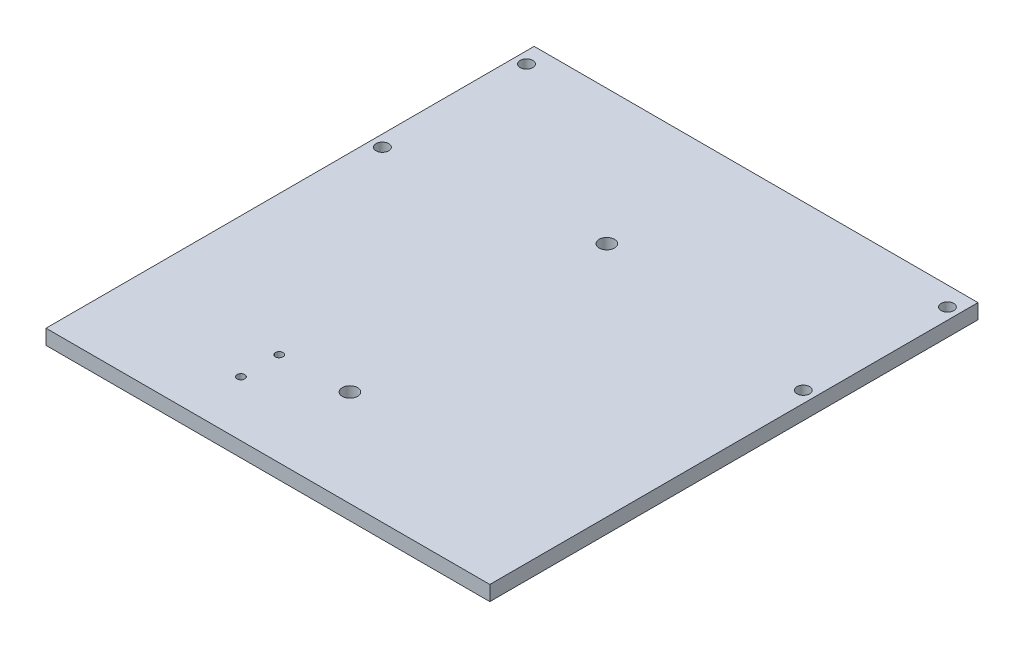
ISO-10303-21;
HEADER;
FILE_DESCRIPTION(('STEP AP214'),'2;1');
FILE_NAME('part.step','',(''),(''),'','','');
FILE_SCHEMA(('AUTOMOTIVE_DESIGN { 1 0 10303 214 1 1 1 1 }'));
ENDSEC;
DATA;
#1=APPLICATION_CONTEXT('core data for automotive mechanical design processes');
#2=APPLICATION_PROTOCOL_DEFINITION('international standard','automotive_design',2000,#1);
#3=PRODUCT_CONTEXT('',#1,'mechanical');
#4=PRODUCT('Part','Part','',(#3));
#5=PRODUCT_RELATED_PRODUCT_CATEGORY('part','',(#4));
#6=PRODUCT_DEFINITION_FORMATION('','',#4);
#7=PRODUCT_DEFINITION_CONTEXT('part definition',#1,'design');
#8=PRODUCT_DEFINITION('design','',#6,#7);
#9=PRODUCT_DEFINITION_SHAPE('','',#8);
#10=(LENGTH_UNIT() NAMED_UNIT(*) SI_UNIT(.MILLI.,.METRE.));
#11=(NAMED_UNIT(*) PLANE_ANGLE_UNIT() SI_UNIT($,.RADIAN.));
#12=(NAMED_UNIT(*) SI_UNIT($,.STERADIAN.) SOLID_ANGLE_UNIT());
#13=UNCERTAINTY_MEASURE_WITH_UNIT(LENGTH_MEASURE(1.E-05),#10,'distance_accuracy_value','');
#14=(GEOMETRIC_REPRESENTATION_CONTEXT(3) GLOBAL_UNCERTAINTY_ASSIGNED_CONTEXT((#13)) GLOBAL_UNIT_ASSIGNED_CONTEXT((#10,
#11,#12)) REPRESENTATION_CONTEXT('',''));
#15=CARTESIAN_POINT('',(0.,0.,0.));
#16=DIRECTION('',(0.,0.,1.));
#17=DIRECTION('',(1.,0.,0.));
#18=AXIS2_PLACEMENT_3D('',#15,#16,#17);
#19=CARTESIAN_POINT('',(0.,3.9,0.));
#20=DIRECTION('',(1.,0.,0.));
#21=DIRECTION('',(0.,0.,-1.));
#22=AXIS2_PLACEMENT_3D('',#19,#20,#21);
#23=PLANE('',#22);
#24=DIRECTION('',(0.,0.,1.));
#25=VECTOR('',#24,1.);
#26=CARTESIAN_POINT('',(0.,0.,0.));
#27=LINE('',#26,#25);
#28=CARTESIAN_POINT('',(0.,0.,-47.7));
#29=VERTEX_POINT('',#28);
#30=CARTESIAN_POINT('',(0.,0.,80.));
#31=VERTEX_POINT('',#30);
#32=EDGE_CURVE('E87',#29,#31,#27,.T.);
#33=ORIENTED_EDGE('',*,*,#32,.T.);
#34=DIRECTION('',(0.,-1.,0.));
#35=VECTOR('',#34,1.);
#36=CARTESIAN_POINT('',(0.,3.9,80.));
#37=LINE('',#36,#35);
#38=CARTESIAN_POINT('',(0.,3.9,80.));
#39=VERTEX_POINT('',#38);
#40=EDGE_CURVE('E90',#39,#31,#37,.T.);
#41=ORIENTED_EDGE('',*,*,#40,.F.);
#42=DIRECTION('',(0.,0.,1.));
#43=VECTOR('',#42,1.);
#44=CARTESIAN_POINT('',(0.,3.9,0.));
#45=LINE('',#44,#43);
#46=CARTESIAN_POINT('',(0.,3.9,-47.7));
#47=VERTEX_POINT('',#46);
#48=EDGE_CURVE('E74',#47,#39,#45,.T.);
#49=ORIENTED_EDGE('',*,*,#48,.F.);
#50=DIRECTION('',(0.,-1.,0.));
#51=VECTOR('',#50,1.);
#52=CARTESIAN_POINT('',(0.,3.9,-47.7));
#53=LINE('',#52,#51);
#54=EDGE_CURVE('E50',#47,#29,#53,.T.);
#55=ORIENTED_EDGE('',*,*,#54,.T.);
#56=EDGE_LOOP('',(#33,#41,#49,#55));
#57=FACE_BOUND('',#56,.T.);
#58=ADVANCED_FACE('F41',(#57),#23,.F.);
#59=CARTESIAN_POINT('',(116.1,3.9,0.));
#60=DIRECTION('',(-1.,0.,0.));
#61=DIRECTION('',(0.,0.,1.));
#62=AXIS2_PLACEMENT_3D('',#59,#60,#61);
#63=PLANE('',#62);
#64=DIRECTION('',(0.,0.,-1.));
#65=VECTOR('',#64,1.);
#66=CARTESIAN_POINT('',(116.1,0.,0.));
#67=LINE('',#66,#65);
#68=CARTESIAN_POINT('',(116.1,0.,80.));
#69=VERTEX_POINT('',#68);
#70=CARTESIAN_POINT('',(116.1,0.,-47.7));
#71=VERTEX_POINT('',#70);
#72=EDGE_CURVE('E69',#69,#71,#67,.T.);
#73=ORIENTED_EDGE('',*,*,#72,.T.);
#74=DIRECTION('',(0.,-1.,0.));
#75=VECTOR('',#74,1.);
#76=CARTESIAN_POINT('',(116.1,3.9,-47.7));
#77=LINE('',#76,#75);
#78=CARTESIAN_POINT('',(116.1,3.9,-47.7));
#79=VERTEX_POINT('',#78);
#80=EDGE_CURVE('E11',#79,#71,#77,.T.);
#81=ORIENTED_EDGE('',*,*,#80,.F.);
#82=DIRECTION('',(0.,0.,-1.));
#83=VECTOR('',#82,1.);
#84=CARTESIAN_POINT('',(116.1,3.9,0.));
#85=LINE('',#84,#83);
#86=CARTESIAN_POINT('',(116.1,3.9,80.));
#87=VERTEX_POINT('',#86);
#88=EDGE_CURVE('E154',#87,#79,#85,.T.);
#89=ORIENTED_EDGE('',*,*,#88,.F.);
#90=DIRECTION('',(0.,1.,0.));
#91=VECTOR('',#90,1.);
#92=CARTESIAN_POINT('',(116.1,3.9,80.));
#93=LINE('',#92,#91);
#94=EDGE_CURVE('E102',#69,#87,#93,.T.);
#95=ORIENTED_EDGE('',*,*,#94,.F.);
#96=EDGE_LOOP('',(#73,#81,#89,#95));
#97=FACE_BOUND('',#96,.T.);
#98=ADVANCED_FACE('F166',(#97),#63,.F.);
#99=CARTESIAN_POINT('',(0.,3.9,-47.7));
#100=DIRECTION('',(0.,0.,1.));
#101=DIRECTION('',(1.,0.,0.));
#102=AXIS2_PLACEMENT_3D('',#99,#100,#101);
#103=PLANE('',#102);
#104=DIRECTION('',(-1.,0.,0.));
#105=VECTOR('',#104,1.);
#106=CARTESIAN_POINT('',(0.,0.,-47.7));
#107=LINE('',#106,#105);
#108=EDGE_CURVE('E155',#71,#29,#107,.T.);
#109=ORIENTED_EDGE('',*,*,#108,.T.);
#110=ORIENTED_EDGE('',*,*,#54,.F.);
#111=DIRECTION('',(-1.,0.,0.));
#112=VECTOR('',#111,1.);
#113=CARTESIAN_POINT('',(0.,3.9,-47.7));
#114=LINE('',#113,#112);
#115=EDGE_CURVE('E58',#79,#47,#114,.T.);
#116=ORIENTED_EDGE('',*,*,#115,.F.);
#117=ORIENTED_EDGE('',*,*,#80,.T.);
#118=EDGE_LOOP('',(#109,#110,#116,#117));
#119=FACE_BOUND('',#118,.T.);
#120=ADVANCED_FACE('F165',(#119),#103,.F.);
#121=CARTESIAN_POINT('',(0.,3.9,0.));
#122=DIRECTION('',(0.,-1.,0.));
#123=DIRECTION('',(0.,0.,-1.));
#124=AXIS2_PLACEMENT_3D('',#121,#122,#123);
#125=PLANE('',#124);
#126=CARTESIAN_POINT('',(36.5,3.9,65.5));
#127=DIRECTION('',(0.,1.,0.));
#128=DIRECTION('',(0.,0.,1.));
#129=AXIS2_PLACEMENT_3D('',#126,#127,#128);
#130=CIRCLE('',#129,0.999999999999998);
#131=CARTESIAN_POINT('',(36.5,3.9,66.5));
#132=VERTEX_POINT('',#131);
#133=EDGE_CURVE('E314',#132,#132,#130,.T.);
#134=ORIENTED_EDGE('',*,*,#133,.F.);
#135=EDGE_LOOP('',(#134));
#136=FACE_BOUND('',#135,.T.);
#137=CARTESIAN_POINT('',(36.5,3.9,55.5));
#138=DIRECTION('',(0.,1.,0.));
#139=DIRECTION('',(0.,0.,1.));
#140=AXIS2_PLACEMENT_3D('',#137,#138,#139);
#141=CIRCLE('',#140,0.999999999999998);
#142=CARTESIAN_POINT('',(36.5,3.9,56.5));
#143=VERTEX_POINT('',#142);
#144=EDGE_CURVE('E322',#143,#143,#141,.T.);
#145=ORIENTED_EDGE('',*,*,#144,.F.);
#146=EDGE_LOOP('',(#145));
#147=FACE_BOUND('',#146,.T.);
#148=CARTESIAN_POINT('',(54.2,3.9,54.7));
#149=DIRECTION('',(0.,1.,0.));
#150=DIRECTION('',(0.,0.,1.));
#151=AXIS2_PLACEMENT_3D('',#148,#149,#150);
#152=CIRCLE('',#151,2.);
#153=CARTESIAN_POINT('',(54.2,3.9,56.7));
#154=VERTEX_POINT('',#153);
#155=EDGE_CURVE('E111',#154,#154,#152,.T.);
#156=ORIENTED_EDGE('',*,*,#155,.F.);
#157=EDGE_LOOP('',(#156));
#158=FACE_BOUND('',#157,.T.);
#159=CARTESIAN_POINT('',(54.2,3.9,-12.5));
#160=DIRECTION('',(0.,1.,0.));
#161=DIRECTION('',(0.,0.,1.));
#162=AXIS2_PLACEMENT_3D('',#159,#160,#161);
#163=CIRCLE('',#162,2.);
#164=CARTESIAN_POINT('',(54.2,3.9,-10.5));
#165=VERTEX_POINT('',#164);
#166=EDGE_CURVE('E114',#165,#165,#163,.T.);
#167=ORIENTED_EDGE('',*,*,#166,.F.);
#168=EDGE_LOOP('',(#167));
#169=FACE_BOUND('',#168,.T.);
#170=CARTESIAN_POINT('',(113.1,3.9,-5.));
#171=DIRECTION('',(0.,-1.,0.));
#172=DIRECTION('',(0.,0.,1.));
#173=AXIS2_PLACEMENT_3D('',#170,#171,#172);
#174=CIRCLE('',#173,1.65);
#175=CARTESIAN_POINT('',(113.1,3.9,-3.35));
#176=VERTEX_POINT('',#175);
#177=EDGE_CURVE('E121',#176,#176,#174,.T.);
#178=ORIENTED_EDGE('',*,*,#177,.T.);
#179=EDGE_LOOP('',(#178));
#180=FACE_BOUND('',#179,.T.);
#181=CARTESIAN_POINT('',(113.1,3.9,-42.7));
#182=DIRECTION('',(0.,-1.,0.));
#183=DIRECTION('',(0.,0.,1.));
#184=AXIS2_PLACEMENT_3D('',#181,#182,#183);
#185=CIRCLE('',#184,1.65);
#186=CARTESIAN_POINT('',(113.1,3.9,-41.05));
#187=VERTEX_POINT('',#186);
#188=EDGE_CURVE('E126',#187,#187,#185,.T.);
#189=ORIENTED_EDGE('',*,*,#188,.T.);
#190=EDGE_LOOP('',(#189));
#191=FACE_BOUND('',#190,.T.);
#192=CARTESIAN_POINT('',(3.,3.9,-5.));
#193=DIRECTION('',(0.,1.,0.));
#194=DIRECTION('',(0.,0.,1.));
#195=AXIS2_PLACEMENT_3D('',#192,#193,#194);
#196=CIRCLE('',#195,1.65);
#197=CARTESIAN_POINT('',(3.,3.9,-3.35));
#198=VERTEX_POINT('',#197);
#199=EDGE_CURVE('E134',#198,#198,#196,.T.);
#200=ORIENTED_EDGE('',*,*,#199,.F.);
#201=EDGE_LOOP('',(#200));
#202=FACE_BOUND('',#201,.T.);
#203=CARTESIAN_POINT('',(3.,3.9,-42.7));
#204=DIRECTION('',(0.,1.,0.));
#205=DIRECTION('',(0.,0.,1.));
#206=AXIS2_PLACEMENT_3D('',#203,#204,#205);
#207=CIRCLE('',#206,1.65);
#208=CARTESIAN_POINT('',(3.,3.9,-41.05));
#209=VERTEX_POINT('',#208);
#210=EDGE_CURVE('E142',#209,#209,#207,.T.);
#211=ORIENTED_EDGE('',*,*,#210,.F.);
#212=EDGE_LOOP('',(#211));
#213=FACE_BOUND('',#212,.T.);
#214=ORIENTED_EDGE('',*,*,#48,.T.);
#215=DIRECTION('',(-1.,0.,0.));
#216=VECTOR('',#215,1.);
#217=CARTESIAN_POINT('',(0.,3.9,80.));
#218=LINE('',#217,#216);
#219=EDGE_CURVE('E105',#87,#39,#218,.T.);
#220=ORIENTED_EDGE('',*,*,#219,.F.);
#221=ORIENTED_EDGE('',*,*,#88,.T.);
#222=ORIENTED_EDGE('',*,*,#115,.T.);
#223=EDGE_LOOP('',(#214,#220,#221,#222));
#224=FACE_BOUND('',#223,.T.);
#225=ADVANCED_FACE('F167',(#136,#147,#158,#169,#180,#191,#202,#213,#224),#125,.F.);
#226=CARTESIAN_POINT('',(0.,0.,0.));
#227=DIRECTION('',(0.,-1.,0.));
#228=DIRECTION('',(0.,0.,-1.));
#229=AXIS2_PLACEMENT_3D('',#226,#227,#228);
#230=PLANE('',#229);
#231=CARTESIAN_POINT('',(36.5,0.,65.5));
#232=DIRECTION('',(0.,1.,0.));
#233=DIRECTION('',(0.,0.,1.));
#234=AXIS2_PLACEMENT_3D('',#231,#232,#233);
#235=CIRCLE('',#234,0.999999999999998);
#236=CARTESIAN_POINT('',(36.5,0.,66.5));
#237=VERTEX_POINT('',#236);
#238=EDGE_CURVE('E312',#237,#237,#235,.T.);
#239=ORIENTED_EDGE('',*,*,#238,.T.);
#240=EDGE_LOOP('',(#239));
#241=FACE_BOUND('',#240,.T.);
#242=CARTESIAN_POINT('',(36.5,0.,55.5));
#243=DIRECTION('',(0.,1.,0.));
#244=DIRECTION('',(0.,0.,1.));
#245=AXIS2_PLACEMENT_3D('',#242,#243,#244);
#246=CIRCLE('',#245,0.999999999999998);
#247=CARTESIAN_POINT('',(36.5,0.,56.5));
#248=VERTEX_POINT('',#247);
#249=EDGE_CURVE('E316',#248,#248,#246,.T.);
#250=ORIENTED_EDGE('',*,*,#249,.T.);
#251=EDGE_LOOP('',(#250));
#252=FACE_BOUND('',#251,.T.);
#253=CARTESIAN_POINT('',(54.2,0.,54.7));
#254=DIRECTION('',(0.,1.,0.));
#255=DIRECTION('',(0.,0.,1.));
#256=AXIS2_PLACEMENT_3D('',#253,#254,#255);
#257=CIRCLE('',#256,2.);
#258=CARTESIAN_POINT('',(54.2,0.,56.7));
#259=VERTEX_POINT('',#258);
#260=EDGE_CURVE('E107',#259,#259,#257,.T.);
#261=ORIENTED_EDGE('',*,*,#260,.T.);
#262=EDGE_LOOP('',(#261));
#263=FACE_BOUND('',#262,.T.);
#264=CARTESIAN_POINT('',(54.2,0.,-12.5));
#265=DIRECTION('',(0.,1.,0.));
#266=DIRECTION('',(0.,0.,1.));
#267=AXIS2_PLACEMENT_3D('',#264,#265,#266);
#268=CIRCLE('',#267,2.);
#269=CARTESIAN_POINT('',(54.2,0.,-10.5));
#270=VERTEX_POINT('',#269);
#271=EDGE_CURVE('E330',#270,#270,#268,.T.);
#272=ORIENTED_EDGE('',*,*,#271,.T.);
#273=EDGE_LOOP('',(#272));
#274=FACE_BOUND('',#273,.T.);
#275=CARTESIAN_POINT('',(113.1,0.,-5.));
#276=DIRECTION('',(0.,-1.,0.));
#277=DIRECTION('',(0.,0.,1.));
#278=AXIS2_PLACEMENT_3D('',#275,#276,#277);
#279=CIRCLE('',#278,1.65);
#280=CARTESIAN_POINT('',(113.1,0.,-3.35));
#281=VERTEX_POINT('',#280);
#282=EDGE_CURVE('E122',#281,#281,#279,.T.);
#283=ORIENTED_EDGE('',*,*,#282,.F.);
#284=EDGE_LOOP('',(#283));
#285=FACE_BOUND('',#284,.T.);
#286=CARTESIAN_POINT('',(113.1,0.,-42.7));
#287=DIRECTION('',(0.,-1.,0.));
#288=DIRECTION('',(0.,0.,1.));
#289=AXIS2_PLACEMENT_3D('',#286,#287,#288);
#290=CIRCLE('',#289,1.65);
#291=CARTESIAN_POINT('',(113.1,0.,-41.05));
#292=VERTEX_POINT('',#291);
#293=EDGE_CURVE('E130',#292,#292,#290,.T.);
#294=ORIENTED_EDGE('',*,*,#293,.F.);
#295=EDGE_LOOP('',(#294));
#296=FACE_BOUND('',#295,.T.);
#297=CARTESIAN_POINT('',(3.,0.,-5.));
#298=DIRECTION('',(0.,1.,0.));
#299=DIRECTION('',(0.,0.,1.));
#300=AXIS2_PLACEMENT_3D('',#297,#298,#299);
#301=CIRCLE('',#300,1.65);
#302=CARTESIAN_POINT('',(3.,0.,-3.35));
#303=VERTEX_POINT('',#302);
#304=EDGE_CURVE('E138',#303,#303,#301,.T.);
#305=ORIENTED_EDGE('',*,*,#304,.T.);
#306=EDGE_LOOP('',(#305));
#307=FACE_BOUND('',#306,.T.);
#308=CARTESIAN_POINT('',(3.,0.,-42.7));
#309=DIRECTION('',(0.,1.,0.));
#310=DIRECTION('',(0.,0.,1.));
#311=AXIS2_PLACEMENT_3D('',#308,#309,#310);
#312=CIRCLE('',#311,1.65);
#313=CARTESIAN_POINT('',(3.,0.,-41.05));
#314=VERTEX_POINT('',#313);
#315=EDGE_CURVE('E94',#314,#314,#312,.T.);
#316=ORIENTED_EDGE('',*,*,#315,.T.);
#317=EDGE_LOOP('',(#316));
#318=FACE_BOUND('',#317,.T.);
#319=ORIENTED_EDGE('',*,*,#32,.F.);
#320=ORIENTED_EDGE('',*,*,#108,.F.);
#321=ORIENTED_EDGE('',*,*,#72,.F.);
#322=DIRECTION('',(1.,0.,0.));
#323=VECTOR('',#322,1.);
#324=CARTESIAN_POINT('',(0.,0.,80.));
#325=LINE('',#324,#323);
#326=EDGE_CURVE('E97',#31,#69,#325,.T.);
#327=ORIENTED_EDGE('',*,*,#326,.F.);
#328=EDGE_LOOP('',(#319,#320,#321,#327));
#329=FACE_BOUND('',#328,.T.);
#330=ADVANCED_FACE('F98',(#241,#252,#263,#274,#285,#296,#307,#318,#329),#230,.T.);
#331=CARTESIAN_POINT('',(3.,0.,-42.7));
#332=DIRECTION('',(0.,1.,0.));
#333=DIRECTION('',(0.,0.,1.));
#334=AXIS2_PLACEMENT_3D('',#331,#332,#333);
#335=CYLINDRICAL_SURFACE('',#334,1.65);
#336=ORIENTED_EDGE('',*,*,#315,.F.);
#337=EDGE_LOOP('',(#336));
#338=FACE_BOUND('',#337,.T.);
#339=ORIENTED_EDGE('',*,*,#210,.T.);
#340=EDGE_LOOP('',(#339));
#341=FACE_BOUND('',#340,.T.);
#342=ADVANCED_FACE('F175',(#338,#341),#335,.F.);
#343=CARTESIAN_POINT('',(3.,0.,-5.));
#344=DIRECTION('',(0.,1.,0.));
#345=DIRECTION('',(0.,0.,1.));
#346=AXIS2_PLACEMENT_3D('',#343,#344,#345);
#347=CYLINDRICAL_SURFACE('',#346,1.65);
#348=ORIENTED_EDGE('',*,*,#304,.F.);
#349=EDGE_LOOP('',(#348));
#350=FACE_BOUND('',#349,.T.);
#351=ORIENTED_EDGE('',*,*,#199,.T.);
#352=EDGE_LOOP('',(#351));
#353=FACE_BOUND('',#352,.T.);
#354=ADVANCED_FACE('F204',(#350,#353),#347,.F.);
#355=CARTESIAN_POINT('',(113.1,0.,-42.7));
#356=DIRECTION('',(0.,1.,0.));
#357=DIRECTION('',(0.,0.,1.));
#358=AXIS2_PLACEMENT_3D('',#355,#356,#357);
#359=CYLINDRICAL_SURFACE('',#358,1.65);
#360=ORIENTED_EDGE('',*,*,#293,.T.);
#361=EDGE_LOOP('',(#360));
#362=FACE_BOUND('',#361,.T.);
#363=ORIENTED_EDGE('',*,*,#188,.F.);
#364=EDGE_LOOP('',(#363));
#365=FACE_BOUND('',#364,.T.);
#366=ADVANCED_FACE('F214',(#362,#365),#359,.F.);
#367=CARTESIAN_POINT('',(113.1,0.,-5.));
#368=DIRECTION('',(0.,1.,0.));
#369=DIRECTION('',(0.,0.,1.));
#370=AXIS2_PLACEMENT_3D('',#367,#368,#369);
#371=CYLINDRICAL_SURFACE('',#370,1.65);
#372=ORIENTED_EDGE('',*,*,#282,.T.);
#373=EDGE_LOOP('',(#372));
#374=FACE_BOUND('',#373,.T.);
#375=ORIENTED_EDGE('',*,*,#177,.F.);
#376=EDGE_LOOP('',(#375));
#377=FACE_BOUND('',#376,.T.);
#378=ADVANCED_FACE('F224',(#374,#377),#371,.F.);
#379=CARTESIAN_POINT('',(0.,0.,80.));
#380=DIRECTION('',(0.,0.,1.));
#381=DIRECTION('',(1.,0.,0.));
#382=AXIS2_PLACEMENT_3D('',#379,#380,#381);
#383=PLANE('',#382);
#384=ORIENTED_EDGE('',*,*,#40,.T.);
#385=ORIENTED_EDGE('',*,*,#326,.T.);
#386=ORIENTED_EDGE('',*,*,#94,.T.);
#387=ORIENTED_EDGE('',*,*,#219,.T.);
#388=EDGE_LOOP('',(#384,#385,#386,#387));
#389=FACE_BOUND('',#388,.T.);
#390=ADVANCED_FACE('F104',(#389),#383,.T.);
#391=CARTESIAN_POINT('',(54.2,0.,-12.5));
#392=DIRECTION('',(0.,1.,0.));
#393=DIRECTION('',(0.,0.,1.));
#394=AXIS2_PLACEMENT_3D('',#391,#392,#393);
#395=CYLINDRICAL_SURFACE('',#394,2.);
#396=ORIENTED_EDGE('',*,*,#271,.F.);
#397=EDGE_LOOP('',(#396));
#398=FACE_BOUND('',#397,.T.);
#399=ORIENTED_EDGE('',*,*,#166,.T.);
#400=EDGE_LOOP('',(#399));
#401=FACE_BOUND('',#400,.T.);
#402=ADVANCED_FACE('F269',(#398,#401),#395,.F.);
#403=CARTESIAN_POINT('',(54.2,0.,54.7));
#404=DIRECTION('',(0.,1.,0.));
#405=DIRECTION('',(0.,0.,1.));
#406=AXIS2_PLACEMENT_3D('',#403,#404,#405);
#407=CYLINDRICAL_SURFACE('',#406,2.);
#408=ORIENTED_EDGE('',*,*,#260,.F.);
#409=EDGE_LOOP('',(#408));
#410=FACE_BOUND('',#409,.T.);
#411=ORIENTED_EDGE('',*,*,#155,.T.);
#412=EDGE_LOOP('',(#411));
#413=FACE_BOUND('',#412,.T.);
#414=ADVANCED_FACE('F277',(#410,#413),#407,.F.);
#415=CARTESIAN_POINT('',(36.5,0.,55.5));
#416=DIRECTION('',(0.,1.,0.));
#417=DIRECTION('',(0.,0.,1.));
#418=AXIS2_PLACEMENT_3D('',#415,#416,#417);
#419=CYLINDRICAL_SURFACE('',#418,0.999999999999998);
#420=ORIENTED_EDGE('',*,*,#249,.F.);
#421=EDGE_LOOP('',(#420));
#422=FACE_BOUND('',#421,.T.);
#423=ORIENTED_EDGE('',*,*,#144,.T.);
#424=EDGE_LOOP('',(#423));
#425=FACE_BOUND('',#424,.T.);
#426=ADVANCED_FACE('F285',(#422,#425),#419,.F.);
#427=CARTESIAN_POINT('',(36.5,0.,65.5));
#428=DIRECTION('',(0.,1.,0.));
#429=DIRECTION('',(0.,0.,1.));
#430=AXIS2_PLACEMENT_3D('',#427,#428,#429);
#431=CYLINDRICAL_SURFACE('',#430,0.999999999999998);
#432=ORIENTED_EDGE('',*,*,#238,.F.);
#433=EDGE_LOOP('',(#432));
#434=FACE_BOUND('',#433,.T.);
#435=ORIENTED_EDGE('',*,*,#133,.T.);
#436=EDGE_LOOP('',(#435));
#437=FACE_BOUND('',#436,.T.);
#438=ADVANCED_FACE('F293',(#434,#437),#431,.F.);
#439=CLOSED_SHELL('',(#58,#98,#120,#225,#330,#342,#354,#366,#378,#390,#402,#414,#426,#438));
#440=MANIFOLD_SOLID_BREP('B2',#439);
#441=ADVANCED_BREP_SHAPE_REPRESENTATION('',(#18,#440),#14);
#442=SHAPE_DEFINITION_REPRESENTATION(#9,#441);
ENDSEC;
END-ISO-10303-21;
